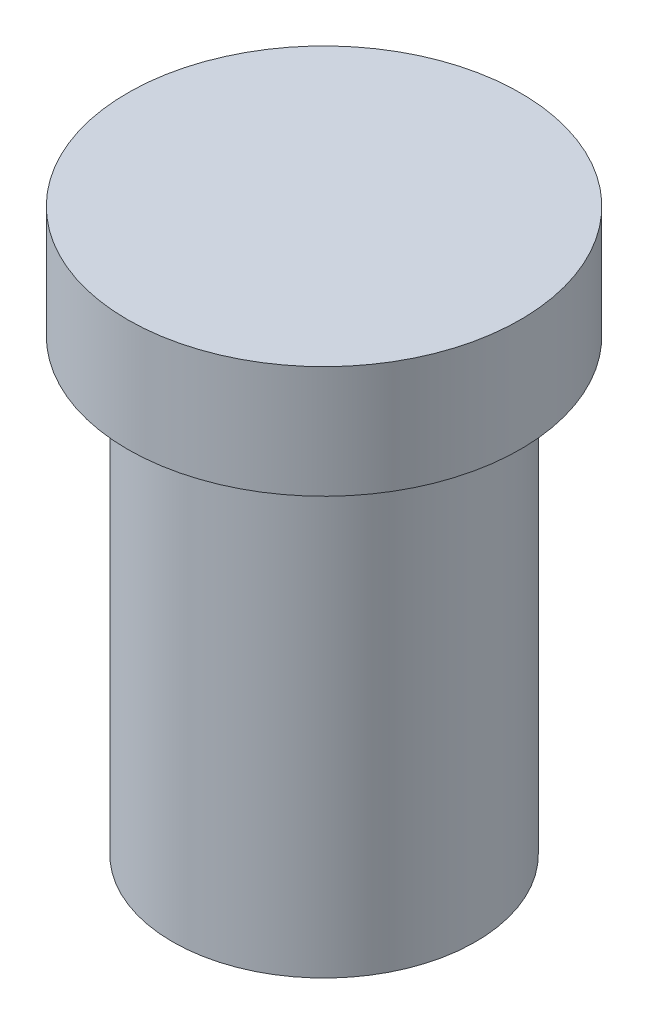
ISO-10303-21;
HEADER;
FILE_DESCRIPTION(('STEP AP214'),'2;1');
FILE_NAME('part.step','',(''),(''),'','','');
FILE_SCHEMA(('AUTOMOTIVE_DESIGN { 1 0 10303 214 1 1 1 1 }'));
ENDSEC;
DATA;
#1=APPLICATION_CONTEXT('core data for automotive mechanical design processes');
#2=APPLICATION_PROTOCOL_DEFINITION('international standard','automotive_design',2000,#1);
#3=PRODUCT_CONTEXT('',#1,'mechanical');
#4=PRODUCT('Part','Part','',(#3));
#5=PRODUCT_RELATED_PRODUCT_CATEGORY('part','',(#4));
#6=PRODUCT_DEFINITION_FORMATION('','',#4);
#7=PRODUCT_DEFINITION_CONTEXT('part definition',#1,'design');
#8=PRODUCT_DEFINITION('design','',#6,#7);
#9=PRODUCT_DEFINITION_SHAPE('','',#8);
#10=(LENGTH_UNIT() NAMED_UNIT(*) SI_UNIT(.MILLI.,.METRE.));
#11=(NAMED_UNIT(*) PLANE_ANGLE_UNIT() SI_UNIT($,.RADIAN.));
#12=(NAMED_UNIT(*) SI_UNIT($,.STERADIAN.) SOLID_ANGLE_UNIT());
#13=UNCERTAINTY_MEASURE_WITH_UNIT(LENGTH_MEASURE(1.E-05),#10,'distance_accuracy_value','');
#14=(GEOMETRIC_REPRESENTATION_CONTEXT(3) GLOBAL_UNCERTAINTY_ASSIGNED_CONTEXT((#13)) GLOBAL_UNIT_ASSIGNED_CONTEXT((#10,
#11,#12)) REPRESENTATION_CONTEXT('',''));
#15=CARTESIAN_POINT('',(0.,0.,0.));
#16=DIRECTION('',(0.,0.,1.));
#17=DIRECTION('',(1.,0.,0.));
#18=AXIS2_PLACEMENT_3D('',#15,#16,#17);
#19=CARTESIAN_POINT('',(0.,-20.,0.));
#20=DIRECTION('',(0.,1.,0.));
#21=DIRECTION('',(0.,0.,1.));
#22=AXIS2_PLACEMENT_3D('',#19,#20,#21);
#23=CYLINDRICAL_SURFACE('',#22,6.75);
#24=CARTESIAN_POINT('',(0.,-20.,0.));
#25=DIRECTION('',(0.,1.,0.));
#26=DIRECTION('',(0.,0.,1.));
#27=AXIS2_PLACEMENT_3D('',#24,#25,#26);
#28=CIRCLE('',#27,6.75);
#29=CARTESIAN_POINT('',(0.,-20.,6.75));
#30=VERTEX_POINT('',#29);
#31=EDGE_CURVE('E10',#30,#30,#28,.T.);
#32=ORIENTED_EDGE('',*,*,#31,.T.);
#33=EDGE_LOOP('',(#32));
#34=FACE_BOUND('',#33,.T.);
#35=CARTESIAN_POINT('',(0.,0.,0.));
#36=DIRECTION('',(0.,1.,0.));
#37=DIRECTION('',(0.,0.,1.));
#38=AXIS2_PLACEMENT_3D('',#35,#36,#37);
#39=CIRCLE('',#38,6.75);
#40=CARTESIAN_POINT('',(0.,0.,6.75));
#41=VERTEX_POINT('',#40);
#42=EDGE_CURVE('E32',#41,#41,#39,.T.);
#43=ORIENTED_EDGE('',*,*,#42,.F.);
#44=EDGE_LOOP('',(#43));
#45=FACE_BOUND('',#44,.T.);
#46=ADVANCED_FACE('F29',(#34,#45),#23,.T.);
#47=CARTESIAN_POINT('',(0.,-20.,0.));
#48=DIRECTION('',(0.,1.,0.));
#49=DIRECTION('',(0.,0.,1.));
#50=AXIS2_PLACEMENT_3D('',#47,#48,#49);
#51=PLANE('',#50);
#52=ORIENTED_EDGE('',*,*,#31,.F.);
#53=EDGE_LOOP('',(#52));
#54=FACE_BOUND('',#53,.T.);
#55=ADVANCED_FACE('F52',(#54),#51,.F.);
#56=CARTESIAN_POINT('',(0.,5.,0.));
#57=DIRECTION('',(0.,-1.,0.));
#58=DIRECTION('',(0.,0.,-1.));
#59=AXIS2_PLACEMENT_3D('',#56,#57,#58);
#60=CYLINDRICAL_SURFACE('',#59,8.75);
#61=CARTESIAN_POINT('',(0.,5.,0.));
#62=DIRECTION('',(0.,1.,0.));
#63=DIRECTION('',(0.,0.,1.));
#64=AXIS2_PLACEMENT_3D('',#61,#62,#63);
#65=CIRCLE('',#64,8.75);
#66=CARTESIAN_POINT('',(0.,5.,8.75));
#67=VERTEX_POINT('',#66);
#68=EDGE_CURVE('E39',#67,#67,#65,.T.);
#69=ORIENTED_EDGE('',*,*,#68,.F.);
#70=EDGE_LOOP('',(#69));
#71=FACE_BOUND('',#70,.T.);
#72=CARTESIAN_POINT('',(0.,0.,0.));
#73=DIRECTION('',(0.,1.,0.));
#74=DIRECTION('',(0.,0.,1.));
#75=AXIS2_PLACEMENT_3D('',#72,#73,#74);
#76=CIRCLE('',#75,8.75);
#77=CARTESIAN_POINT('',(0.,0.,8.75));
#78=VERTEX_POINT('',#77);
#79=EDGE_CURVE('E41',#78,#78,#76,.T.);
#80=ORIENTED_EDGE('',*,*,#79,.T.);
#81=EDGE_LOOP('',(#80));
#82=FACE_BOUND('',#81,.T.);
#83=ADVANCED_FACE('F49',(#71,#82),#60,.T.);
#84=CARTESIAN_POINT('',(0.,5.,0.));
#85=DIRECTION('',(0.,1.,0.));
#86=DIRECTION('',(0.,0.,1.));
#87=AXIS2_PLACEMENT_3D('',#84,#85,#86);
#88=PLANE('',#87);
#89=ORIENTED_EDGE('',*,*,#68,.T.);
#90=EDGE_LOOP('',(#89));
#91=FACE_BOUND('',#90,.T.);
#92=ADVANCED_FACE('F47',(#91),#88,.T.);
#93=CARTESIAN_POINT('',(0.,0.,0.));
#94=DIRECTION('',(0.,1.,0.));
#95=DIRECTION('',(0.,0.,1.));
#96=AXIS2_PLACEMENT_3D('',#93,#94,#95);
#97=PLANE('',#96);
#98=ORIENTED_EDGE('',*,*,#42,.T.);
#99=EDGE_LOOP('',(#98));
#100=FACE_BOUND('',#99,.T.);
#101=ORIENTED_EDGE('',*,*,#79,.F.);
#102=EDGE_LOOP('',(#101));
#103=FACE_BOUND('',#102,.T.);
#104=ADVANCED_FACE('F56',(#100,#103),#97,.F.);
#105=CLOSED_SHELL('',(#46,#55,#83,#92,#104));
#106=MANIFOLD_SOLID_BREP('B2',#105);
#107=ADVANCED_BREP_SHAPE_REPRESENTATION('',(#18,#106),#14);
#108=SHAPE_DEFINITION_REPRESENTATION(#9,#107);
ENDSEC;
END-ISO-10303-21;
